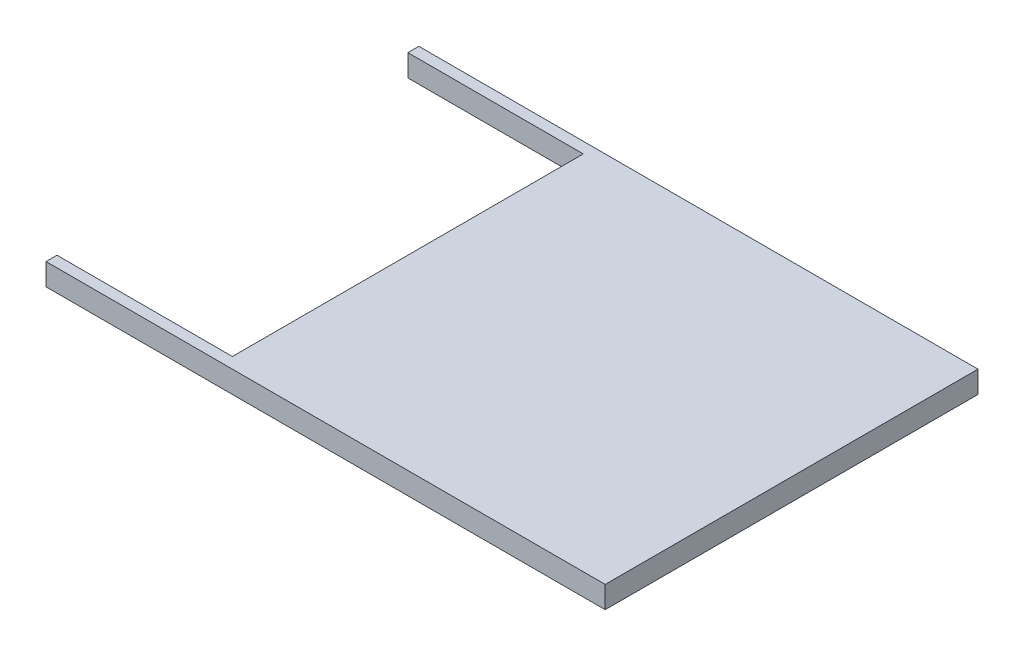
ISO-10303-21;
HEADER;
FILE_DESCRIPTION(('STEP AP214'),'2;1');
FILE_NAME('part.step','',(''),(''),'','','');
FILE_SCHEMA(('AUTOMOTIVE_DESIGN { 1 0 10303 214 1 1 1 1 }'));
ENDSEC;
DATA;
#1=APPLICATION_CONTEXT('core data for automotive mechanical design processes');
#2=APPLICATION_PROTOCOL_DEFINITION('international standard','automotive_design',2000,#1);
#3=PRODUCT_CONTEXT('',#1,'mechanical');
#4=PRODUCT('Part','Part','',(#3));
#5=PRODUCT_RELATED_PRODUCT_CATEGORY('part','',(#4));
#6=PRODUCT_DEFINITION_FORMATION('','',#4);
#7=PRODUCT_DEFINITION_CONTEXT('part definition',#1,'design');
#8=PRODUCT_DEFINITION('design','',#6,#7);
#9=PRODUCT_DEFINITION_SHAPE('','',#8);
#10=(LENGTH_UNIT() NAMED_UNIT(*) SI_UNIT(.MILLI.,.METRE.));
#11=(NAMED_UNIT(*) PLANE_ANGLE_UNIT() SI_UNIT($,.RADIAN.));
#12=(NAMED_UNIT(*) SI_UNIT($,.STERADIAN.) SOLID_ANGLE_UNIT());
#13=UNCERTAINTY_MEASURE_WITH_UNIT(LENGTH_MEASURE(1.E-05),#10,'distance_accuracy_value','');
#14=(GEOMETRIC_REPRESENTATION_CONTEXT(3) GLOBAL_UNCERTAINTY_ASSIGNED_CONTEXT((#13)) GLOBAL_UNIT_ASSIGNED_CONTEXT((#10,
#11,#12)) REPRESENTATION_CONTEXT('',''));
#15=CARTESIAN_POINT('',(0.,0.,0.));
#16=DIRECTION('',(0.,0.,1.));
#17=DIRECTION('',(1.,0.,0.));
#18=AXIS2_PLACEMENT_3D('',#15,#16,#17);
#19=CARTESIAN_POINT('',(0.,0.,0.));
#20=DIRECTION('',(0.,1.,0.));
#21=DIRECTION('',(0.,0.,1.));
#22=AXIS2_PLACEMENT_3D('',#19,#20,#21);
#23=PLANE('',#22);
#24=DIRECTION('',(0.,0.,-1.));
#25=VECTOR('',#24,1.);
#26=CARTESIAN_POINT('',(-33.003452615551,0.,0.));
#27=LINE('',#26,#25);
#28=CARTESIAN_POINT('',(-33.003452615551,0.,53.975));
#29=VERTEX_POINT('',#28);
#30=CARTESIAN_POINT('',(-33.003452615551,0.,50.8));
#31=VERTEX_POINT('',#30);
#32=EDGE_CURVE('E108',#29,#31,#27,.T.);
#33=ORIENTED_EDGE('',*,*,#32,.F.);
#34=DIRECTION('',(1.,0.,0.));
#35=VECTOR('',#34,1.);
#36=CARTESIAN_POINT('',(0.,0.,53.975));
#37=LINE('',#36,#35);
#38=CARTESIAN_POINT('',(128.921547384449,0.,53.975));
#39=VERTEX_POINT('',#38);
#40=EDGE_CURVE('E200',#29,#39,#37,.T.);
#41=ORIENTED_EDGE('',*,*,#40,.T.);
#42=DIRECTION('',(0.,0.,-1.));
#43=VECTOR('',#42,1.);
#44=CARTESIAN_POINT('',(128.921547384449,0.,53.975));
#45=LINE('',#44,#43);
#46=CARTESIAN_POINT('',(128.921547384449,0.,-53.975));
#47=VERTEX_POINT('',#46);
#48=EDGE_CURVE('E191',#39,#47,#45,.T.);
#49=ORIENTED_EDGE('',*,*,#48,.T.);
#50=DIRECTION('',(1.,0.,0.));
#51=VECTOR('',#50,1.);
#52=CARTESIAN_POINT('',(0.,0.,-53.975));
#53=LINE('',#52,#51);
#54=CARTESIAN_POINT('',(-33.003452615551,0.,-53.975));
#55=VERTEX_POINT('',#54);
#56=EDGE_CURVE('E167',#55,#47,#53,.T.);
#57=ORIENTED_EDGE('',*,*,#56,.F.);
#58=CARTESIAN_POINT('',(-33.003452615551,0.,-50.8));
#59=VERTEX_POINT('',#58);
#60=EDGE_CURVE('E156',#59,#55,#27,.T.);
#61=ORIENTED_EDGE('',*,*,#60,.F.);
#62=DIRECTION('',(1.,0.,0.));
#63=VECTOR('',#62,1.);
#64=CARTESIAN_POINT('',(0.,0.,-50.8));
#65=LINE('',#64,#63);
#66=CARTESIAN_POINT('',(17.7965473844489,0.,-50.8));
#67=VERTEX_POINT('',#66);
#68=EDGE_CURVE('E164',#59,#67,#65,.T.);
#69=ORIENTED_EDGE('',*,*,#68,.T.);
#70=DIRECTION('',(0.,0.,1.));
#71=VECTOR('',#70,1.);
#72=CARTESIAN_POINT('',(17.7965473844489,0.,0.));
#73=LINE('',#72,#71);
#74=CARTESIAN_POINT('',(17.796547384449,0.,50.8));
#75=VERTEX_POINT('',#74);
#76=EDGE_CURVE('E177',#67,#75,#73,.T.);
#77=ORIENTED_EDGE('',*,*,#76,.T.);
#78=DIRECTION('',(1.,0.,0.));
#79=VECTOR('',#78,1.);
#80=CARTESIAN_POINT('',(0.,0.,50.8));
#81=LINE('',#80,#79);
#82=EDGE_CURVE('E176',#31,#75,#81,.T.);
#83=ORIENTED_EDGE('',*,*,#82,.F.);
#84=EDGE_LOOP('',(#33,#41,#49,#57,#61,#69,#77,#83));
#85=FACE_BOUND('',#84,.T.);
#86=ADVANCED_FACE('F92',(#85),#23,.T.);
#87=CARTESIAN_POINT('',(0.,-6.35,0.));
#88=DIRECTION('',(0.,1.,0.));
#89=DIRECTION('',(0.,0.,1.));
#90=AXIS2_PLACEMENT_3D('',#87,#88,#89);
#91=PLANE('',#90);
#92=DIRECTION('',(1.,0.,0.));
#93=VECTOR('',#92,1.);
#94=CARTESIAN_POINT('',(0.,-6.35,53.975));
#95=LINE('',#94,#93);
#96=CARTESIAN_POINT('',(-33.003452615551,-6.35,53.975));
#97=VERTEX_POINT('',#96);
#98=CARTESIAN_POINT('',(128.921547384449,-6.35,53.975));
#99=VERTEX_POINT('',#98);
#100=EDGE_CURVE('E195',#97,#99,#95,.T.);
#101=ORIENTED_EDGE('',*,*,#100,.F.);
#102=DIRECTION('',(0.,0.,-1.));
#103=VECTOR('',#102,1.);
#104=CARTESIAN_POINT('',(-33.003452615551,-6.35,0.));
#105=LINE('',#104,#103);
#106=CARTESIAN_POINT('',(-33.003452615551,-6.35,50.8));
#107=VERTEX_POINT('',#106);
#108=EDGE_CURVE('E238',#97,#107,#105,.T.);
#109=ORIENTED_EDGE('',*,*,#108,.T.);
#110=DIRECTION('',(1.,0.,0.));
#111=VECTOR('',#110,1.);
#112=CARTESIAN_POINT('',(0.,-6.35,50.8));
#113=LINE('',#112,#111);
#114=CARTESIAN_POINT('',(17.796547384449,-6.35,50.8));
#115=VERTEX_POINT('',#114);
#116=EDGE_CURVE('E194',#107,#115,#113,.T.);
#117=ORIENTED_EDGE('',*,*,#116,.T.);
#118=DIRECTION('',(0.,0.,1.));
#119=VECTOR('',#118,1.);
#120=CARTESIAN_POINT('',(17.7965473844489,-6.35,0.));
#121=LINE('',#120,#119);
#122=CARTESIAN_POINT('',(17.7965473844489,-6.35,-50.8));
#123=VERTEX_POINT('',#122);
#124=EDGE_CURVE('E181',#123,#115,#121,.T.);
#125=ORIENTED_EDGE('',*,*,#124,.F.);
#126=DIRECTION('',(1.,0.,0.));
#127=VECTOR('',#126,1.);
#128=CARTESIAN_POINT('',(0.,-6.35,-50.8));
#129=LINE('',#128,#127);
#130=CARTESIAN_POINT('',(-33.003452615551,-6.35,-50.8));
#131=VERTEX_POINT('',#130);
#132=EDGE_CURVE('E247',#131,#123,#129,.T.);
#133=ORIENTED_EDGE('',*,*,#132,.F.);
#134=CARTESIAN_POINT('',(-33.003452615551,-6.35,-53.975));
#135=VERTEX_POINT('',#134);
#136=EDGE_CURVE('E115',#131,#135,#105,.T.);
#137=ORIENTED_EDGE('',*,*,#136,.T.);
#138=DIRECTION('',(1.,0.,0.));
#139=VECTOR('',#138,1.);
#140=CARTESIAN_POINT('',(0.,-6.35,-53.975));
#141=LINE('',#140,#139);
#142=CARTESIAN_POINT('',(128.921547384449,-6.35,-53.975));
#143=VERTEX_POINT('',#142);
#144=EDGE_CURVE('E101',#135,#143,#141,.T.);
#145=ORIENTED_EDGE('',*,*,#144,.T.);
#146=DIRECTION('',(0.,0.,-1.));
#147=VECTOR('',#146,1.);
#148=CARTESIAN_POINT('',(128.921547384449,-6.35,53.975));
#149=LINE('',#148,#147);
#150=EDGE_CURVE('E206',#99,#143,#149,.T.);
#151=ORIENTED_EDGE('',*,*,#150,.F.);
#152=EDGE_LOOP('',(#101,#109,#117,#125,#133,#137,#145,#151));
#153=FACE_BOUND('',#152,.T.);
#154=ADVANCED_FACE('F231',(#153),#91,.F.);
#155=CARTESIAN_POINT('',(0.,-6.35,53.975));
#156=DIRECTION('',(0.,0.,1.));
#157=DIRECTION('',(1.,0.,0.));
#158=AXIS2_PLACEMENT_3D('',#155,#156,#157);
#159=PLANE('',#158);
#160=DIRECTION('',(0.,1.,0.));
#161=VECTOR('',#160,1.);
#162=CARTESIAN_POINT('',(-33.003452615551,-6.35,53.975));
#163=LINE('',#162,#161);
#164=EDGE_CURVE('E183',#97,#29,#163,.T.);
#165=ORIENTED_EDGE('',*,*,#164,.F.);
#166=ORIENTED_EDGE('',*,*,#100,.T.);
#167=DIRECTION('',(0.,1.,0.));
#168=VECTOR('',#167,1.);
#169=CARTESIAN_POINT('',(128.921547384449,-6.35,53.975));
#170=LINE('',#169,#168);
#171=EDGE_CURVE('E210',#99,#39,#170,.T.);
#172=ORIENTED_EDGE('',*,*,#171,.T.);
#173=ORIENTED_EDGE('',*,*,#40,.F.);
#174=EDGE_LOOP('',(#165,#166,#172,#173));
#175=FACE_BOUND('',#174,.T.);
#176=ADVANCED_FACE('F228',(#175),#159,.T.);
#177=CARTESIAN_POINT('',(0.,-6.35,-53.975));
#178=DIRECTION('',(0.,0.,1.));
#179=DIRECTION('',(1.,0.,0.));
#180=AXIS2_PLACEMENT_3D('',#177,#178,#179);
#181=PLANE('',#180);
#182=ORIENTED_EDGE('',*,*,#144,.F.);
#183=DIRECTION('',(0.,1.,0.));
#184=VECTOR('',#183,1.);
#185=CARTESIAN_POINT('',(-33.003452615551,-6.35,-53.975));
#186=LINE('',#185,#184);
#187=EDGE_CURVE('E169',#135,#55,#186,.T.);
#188=ORIENTED_EDGE('',*,*,#187,.T.);
#189=ORIENTED_EDGE('',*,*,#56,.T.);
#190=DIRECTION('',(0.,1.,0.));
#191=VECTOR('',#190,1.);
#192=CARTESIAN_POINT('',(128.921547384449,-6.35,-53.975));
#193=LINE('',#192,#191);
#194=EDGE_CURVE('E203',#143,#47,#193,.T.);
#195=ORIENTED_EDGE('',*,*,#194,.F.);
#196=EDGE_LOOP('',(#182,#188,#189,#195));
#197=FACE_BOUND('',#196,.T.);
#198=ADVANCED_FACE('F233',(#197),#181,.F.);
#199=CARTESIAN_POINT('',(128.921547384449,-6.35,53.975));
#200=DIRECTION('',(1.,0.,0.));
#201=DIRECTION('',(0.,0.,-1.));
#202=AXIS2_PLACEMENT_3D('',#199,#200,#201);
#203=PLANE('',#202);
#204=ORIENTED_EDGE('',*,*,#48,.F.);
#205=ORIENTED_EDGE('',*,*,#171,.F.);
#206=ORIENTED_EDGE('',*,*,#150,.T.);
#207=ORIENTED_EDGE('',*,*,#194,.T.);
#208=EDGE_LOOP('',(#204,#205,#206,#207));
#209=FACE_BOUND('',#208,.T.);
#210=ADVANCED_FACE('F94',(#209),#203,.T.);
#211=CARTESIAN_POINT('',(17.7965473844489,-6.35,0.));
#212=DIRECTION('',(-1.,0.,0.));
#213=DIRECTION('',(0.,0.,1.));
#214=AXIS2_PLACEMENT_3D('',#211,#212,#213);
#215=PLANE('',#214);
#216=ORIENTED_EDGE('',*,*,#76,.F.);
#217=DIRECTION('',(0.,1.,0.));
#218=VECTOR('',#217,1.);
#219=CARTESIAN_POINT('',(17.7965473844489,-6.35,-50.8));
#220=LINE('',#219,#218);
#221=EDGE_CURVE('E174',#123,#67,#220,.T.);
#222=ORIENTED_EDGE('',*,*,#221,.F.);
#223=ORIENTED_EDGE('',*,*,#124,.T.);
#224=DIRECTION('',(0.,1.,0.));
#225=VECTOR('',#224,1.);
#226=CARTESIAN_POINT('',(17.796547384449,-6.35,50.8));
#227=LINE('',#226,#225);
#228=EDGE_CURVE('E187',#115,#75,#227,.T.);
#229=ORIENTED_EDGE('',*,*,#228,.T.);
#230=EDGE_LOOP('',(#216,#222,#223,#229));
#231=FACE_BOUND('',#230,.T.);
#232=ADVANCED_FACE('F255',(#231),#215,.T.);
#233=CARTESIAN_POINT('',(0.,-6.35,50.8));
#234=DIRECTION('',(0.,0.,1.));
#235=DIRECTION('',(1.,0.,0.));
#236=AXIS2_PLACEMENT_3D('',#233,#234,#235);
#237=PLANE('',#236);
#238=ORIENTED_EDGE('',*,*,#116,.F.);
#239=DIRECTION('',(0.,1.,0.));
#240=VECTOR('',#239,1.);
#241=CARTESIAN_POINT('',(-33.003452615551,-6.35,50.8));
#242=LINE('',#241,#240);
#243=EDGE_CURVE('E235',#107,#31,#242,.T.);
#244=ORIENTED_EDGE('',*,*,#243,.T.);
#245=ORIENTED_EDGE('',*,*,#82,.T.);
#246=ORIENTED_EDGE('',*,*,#228,.F.);
#247=EDGE_LOOP('',(#238,#244,#245,#246));
#248=FACE_BOUND('',#247,.T.);
#249=ADVANCED_FACE('F256',(#248),#237,.F.);
#250=CARTESIAN_POINT('',(0.,-6.35,-50.8));
#251=DIRECTION('',(0.,0.,1.));
#252=DIRECTION('',(1.,0.,0.));
#253=AXIS2_PLACEMENT_3D('',#250,#251,#252);
#254=PLANE('',#253);
#255=DIRECTION('',(0.,1.,0.));
#256=VECTOR('',#255,1.);
#257=CARTESIAN_POINT('',(-33.003452615551,-6.35,-50.8));
#258=LINE('',#257,#256);
#259=EDGE_CURVE('E12',#131,#59,#258,.T.);
#260=ORIENTED_EDGE('',*,*,#259,.F.);
#261=ORIENTED_EDGE('',*,*,#132,.T.);
#262=ORIENTED_EDGE('',*,*,#221,.T.);
#263=ORIENTED_EDGE('',*,*,#68,.F.);
#264=EDGE_LOOP('',(#260,#261,#262,#263));
#265=FACE_BOUND('',#264,.T.);
#266=ADVANCED_FACE('F172',(#265),#254,.T.);
#267=CARTESIAN_POINT('',(-33.003452615551,35.56,0.));
#268=DIRECTION('',(1.,0.,0.));
#269=DIRECTION('',(0.,0.,-1.));
#270=AXIS2_PLACEMENT_3D('',#267,#268,#269);
#271=PLANE('',#270);
#272=ORIENTED_EDGE('',*,*,#136,.F.);
#273=ORIENTED_EDGE('',*,*,#259,.T.);
#274=ORIENTED_EDGE('',*,*,#60,.T.);
#275=ORIENTED_EDGE('',*,*,#187,.F.);
#276=EDGE_LOOP('',(#272,#273,#274,#275));
#277=FACE_BOUND('',#276,.T.);
#278=ADVANCED_FACE('F155',(#277),#271,.F.);
#279=ORIENTED_EDGE('',*,*,#164,.T.);
#280=ORIENTED_EDGE('',*,*,#32,.T.);
#281=ORIENTED_EDGE('',*,*,#243,.F.);
#282=ORIENTED_EDGE('',*,*,#108,.F.);
#283=EDGE_LOOP('',(#279,#280,#281,#282));
#284=FACE_BOUND('',#283,.T.);
#285=ADVANCED_FACE('F257',(#284),#271,.F.);
#286=CLOSED_SHELL('',(#86,#154,#176,#198,#210,#232,#249,#266,#278,#285));
#287=MANIFOLD_SOLID_BREP('B2',#286);
#288=ADVANCED_BREP_SHAPE_REPRESENTATION('',(#18,#287),#14);
#289=SHAPE_DEFINITION_REPRESENTATION(#9,#288);
ENDSEC;
END-ISO-10303-21;
